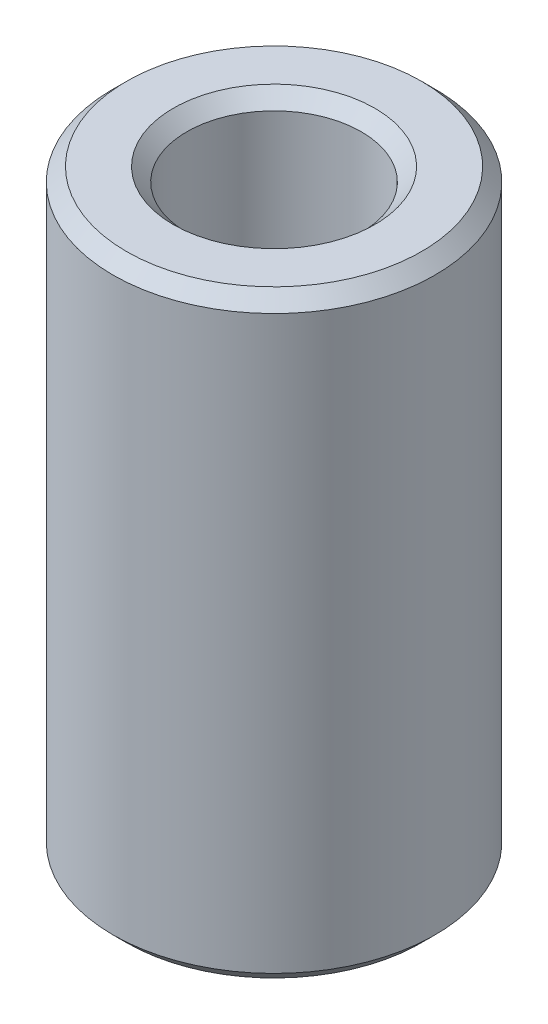
ISO-10303-21;
HEADER;
FILE_DESCRIPTION(('STEP AP214'),'2;1');
FILE_NAME('part.step','',(''),(''),'','','');
FILE_SCHEMA(('AUTOMOTIVE_DESIGN { 1 0 10303 214 1 1 1 1 }'));
ENDSEC;
DATA;
#1=APPLICATION_CONTEXT('core data for automotive mechanical design processes');
#2=APPLICATION_PROTOCOL_DEFINITION('international standard','automotive_design',2000,#1);
#3=PRODUCT_CONTEXT('',#1,'mechanical');
#4=PRODUCT('Part','Part','',(#3));
#5=PRODUCT_RELATED_PRODUCT_CATEGORY('part','',(#4));
#6=PRODUCT_DEFINITION_FORMATION('','',#4);
#7=PRODUCT_DEFINITION_CONTEXT('part definition',#1,'design');
#8=PRODUCT_DEFINITION('design','',#6,#7);
#9=PRODUCT_DEFINITION_SHAPE('','',#8);
#10=(LENGTH_UNIT() NAMED_UNIT(*) SI_UNIT(.MILLI.,.METRE.));
#11=(NAMED_UNIT(*) PLANE_ANGLE_UNIT() SI_UNIT($,.RADIAN.));
#12=(NAMED_UNIT(*) SI_UNIT($,.STERADIAN.) SOLID_ANGLE_UNIT());
#13=UNCERTAINTY_MEASURE_WITH_UNIT(LENGTH_MEASURE(1.E-05),#10,'distance_accuracy_value','');
#14=(GEOMETRIC_REPRESENTATION_CONTEXT(3) GLOBAL_UNCERTAINTY_ASSIGNED_CONTEXT((#13)) GLOBAL_UNIT_ASSIGNED_CONTEXT((#10,
#11,#12)) REPRESENTATION_CONTEXT('',''));
#15=CARTESIAN_POINT('',(0.,0.,0.));
#16=DIRECTION('',(0.,0.,1.));
#17=DIRECTION('',(1.,0.,0.));
#18=AXIS2_PLACEMENT_3D('',#15,#16,#17);
#19=CARTESIAN_POINT('',(0.,46.4537230556615,0.));
#20=DIRECTION('',(0.,-1.,0.));
#21=DIRECTION('',(0.,0.,-1.));
#22=AXIS2_PLACEMENT_3D('',#19,#20,#21);
#23=CYLINDRICAL_SURFACE('',#22,12.5);
#24=CARTESIAN_POINT('',(0.,1.05193500910648,0.));
#25=DIRECTION('',(0.,1.,0.));
#26=DIRECTION('',(0.,0.,1.));
#27=AXIS2_PLACEMENT_3D('',#24,#25,#26);
#28=CIRCLE('',#27,12.5);
#29=CARTESIAN_POINT('',(0.,1.05193500910648,12.5));
#30=VERTEX_POINT('',#29);
#31=EDGE_CURVE('E10',#30,#30,#28,.T.);
#32=ORIENTED_EDGE('',*,*,#31,.T.);
#33=EDGE_LOOP('',(#32));
#34=FACE_BOUND('',#33,.T.);
#35=CARTESIAN_POINT('',(0.,45.401788046555,0.));
#36=DIRECTION('',(0.,1.,0.));
#37=DIRECTION('',(0.,0.,1.));
#38=AXIS2_PLACEMENT_3D('',#35,#36,#37);
#39=CIRCLE('',#38,12.5);
#40=CARTESIAN_POINT('',(0.,45.401788046555,12.5));
#41=VERTEX_POINT('',#40);
#42=EDGE_CURVE('E50',#41,#41,#39,.F.);
#43=ORIENTED_EDGE('',*,*,#42,.T.);
#44=EDGE_LOOP('',(#43));
#45=FACE_BOUND('',#44,.T.);
#46=ADVANCED_FACE('F39',(#34,#45),#23,.T.);
#47=CARTESIAN_POINT('',(0.,46.4537230556615,0.));
#48=DIRECTION('',(0.,1.,0.));
#49=DIRECTION('',(0.,0.,1.));
#50=AXIS2_PLACEMENT_3D('',#47,#48,#49);
#51=PLANE('',#50);
#52=CARTESIAN_POINT('',(0.,46.4537230556615,0.));
#53=DIRECTION('',(0.,1.,0.));
#54=DIRECTION('',(0.,0.,1.));
#55=AXIS2_PLACEMENT_3D('',#52,#53,#54);
#56=CIRCLE('',#55,7.82351300067226);
#57=CARTESIAN_POINT('',(0.,46.4537230556615,7.82351300067226));
#58=VERTEX_POINT('',#57);
#59=EDGE_CURVE('E58',#58,#58,#56,.F.);
#60=ORIENTED_EDGE('',*,*,#59,.T.);
#61=EDGE_LOOP('',(#60));
#62=FACE_BOUND('',#61,.T.);
#63=CARTESIAN_POINT('',(0.,46.4537230556615,0.));
#64=DIRECTION('',(0.,1.,0.));
#65=DIRECTION('',(0.,0.,1.));
#66=AXIS2_PLACEMENT_3D('',#63,#64,#65);
#67=CIRCLE('',#66,11.4480649908935);
#68=CARTESIAN_POINT('',(0.,46.4537230556615,11.4480649908935));
#69=VERTEX_POINT('',#68);
#70=EDGE_CURVE('E61',#69,#69,#67,.T.);
#71=ORIENTED_EDGE('',*,*,#70,.T.);
#72=EDGE_LOOP('',(#71));
#73=FACE_BOUND('',#72,.T.);
#74=ADVANCED_FACE('F88',(#62,#73),#51,.T.);
#75=CARTESIAN_POINT('',(0.,0.,0.));
#76=DIRECTION('',(0.,1.,0.));
#77=DIRECTION('',(0.,0.,1.));
#78=AXIS2_PLACEMENT_3D('',#75,#76,#77);
#79=PLANE('',#78);
#80=CARTESIAN_POINT('',(0.,0.,0.));
#81=DIRECTION('',(0.,1.,0.));
#82=DIRECTION('',(0.,0.,1.));
#83=AXIS2_PLACEMENT_3D('',#80,#81,#82);
#84=CIRCLE('',#83,7.82351300067225);
#85=CARTESIAN_POINT('',(0.,0.,7.82351300067225));
#86=VERTEX_POINT('',#85);
#87=EDGE_CURVE('E51',#86,#86,#84,.T.);
#88=ORIENTED_EDGE('',*,*,#87,.T.);
#89=EDGE_LOOP('',(#88));
#90=FACE_BOUND('',#89,.T.);
#91=CARTESIAN_POINT('',(0.,0.,0.));
#92=DIRECTION('',(0.,1.,0.));
#93=DIRECTION('',(0.,0.,1.));
#94=AXIS2_PLACEMENT_3D('',#91,#92,#93);
#95=CIRCLE('',#94,11.4480649908935);
#96=CARTESIAN_POINT('',(0.,0.,11.4480649908935));
#97=VERTEX_POINT('',#96);
#98=EDGE_CURVE('E54',#97,#97,#95,.F.);
#99=ORIENTED_EDGE('',*,*,#98,.T.);
#100=EDGE_LOOP('',(#99));
#101=FACE_BOUND('',#100,.T.);
#102=ADVANCED_FACE('F83',(#90,#101),#79,.F.);
#103=CARTESIAN_POINT('',(0.,46.4537230556615,0.));
#104=DIRECTION('',(0.,-1.,0.));
#105=DIRECTION('',(0.,0.,-1.));
#106=AXIS2_PLACEMENT_3D('',#103,#104,#105);
#107=CYLINDRICAL_SURFACE('',#106,6.77157799156576);
#108=CARTESIAN_POINT('',(0.,45.401788046555,0.));
#109=DIRECTION('',(0.,1.,0.));
#110=DIRECTION('',(0.,0.,1.));
#111=AXIS2_PLACEMENT_3D('',#108,#109,#110);
#112=CIRCLE('',#111,6.77157799156576);
#113=CARTESIAN_POINT('',(0.,45.401788046555,6.77157799156576));
#114=VERTEX_POINT('',#113);
#115=EDGE_CURVE('E67',#114,#114,#112,.T.);
#116=ORIENTED_EDGE('',*,*,#115,.T.);
#117=EDGE_LOOP('',(#116));
#118=FACE_BOUND('',#117,.T.);
#119=CARTESIAN_POINT('',(0.,1.05193500910649,0.));
#120=DIRECTION('',(0.,1.,0.));
#121=DIRECTION('',(0.,0.,1.));
#122=AXIS2_PLACEMENT_3D('',#119,#120,#121);
#123=CIRCLE('',#122,6.77157799156576);
#124=CARTESIAN_POINT('',(0.,1.05193500910649,6.77157799156576));
#125=VERTEX_POINT('',#124);
#126=EDGE_CURVE('E69',#125,#125,#123,.F.);
#127=ORIENTED_EDGE('',*,*,#126,.T.);
#128=EDGE_LOOP('',(#127));
#129=FACE_BOUND('',#128,.T.);
#130=ADVANCED_FACE('F71',(#118,#129),#107,.F.);
#131=CARTESIAN_POINT('',(0.,45.401788046555,0.));
#132=DIRECTION('',(0.,1.,0.));
#133=DIRECTION('',(0.,0.,1.));
#134=AXIS2_PLACEMENT_3D('',#131,#132,#133);
#135=CONICAL_SURFACE('',#134,6.77157799156576,0.785398163397458);
#136=ORIENTED_EDGE('',*,*,#59,.F.);
#137=EDGE_LOOP('',(#136));
#138=FACE_BOUND('',#137,.T.);
#139=ORIENTED_EDGE('',*,*,#115,.F.);
#140=EDGE_LOOP('',(#139));
#141=FACE_BOUND('',#140,.T.);
#142=ADVANCED_FACE('F77',(#138,#141),#135,.F.);
#143=CARTESIAN_POINT('',(0.,0.,0.));
#144=DIRECTION('',(0.,-1.,0.));
#145=DIRECTION('',(0.,0.,-1.));
#146=AXIS2_PLACEMENT_3D('',#143,#144,#145);
#147=CONICAL_SURFACE('',#146,7.82351300067225,0.785398163397448);
#148=ORIENTED_EDGE('',*,*,#126,.F.);
#149=EDGE_LOOP('',(#148));
#150=FACE_BOUND('',#149,.T.);
#151=ORIENTED_EDGE('',*,*,#87,.F.);
#152=EDGE_LOOP('',(#151));
#153=FACE_BOUND('',#152,.T.);
#154=ADVANCED_FACE('F73',(#150,#153),#147,.F.);
#155=CARTESIAN_POINT('',(0.,1.05193500910648,0.));
#156=DIRECTION('',(0.,1.,0.));
#157=DIRECTION('',(0.,0.,1.));
#158=AXIS2_PLACEMENT_3D('',#155,#156,#157);
#159=CONICAL_SURFACE('',#158,12.5,0.785398163397452);
#160=CARTESIAN_POINT('',(0.,0.,11.4480649908935));
#161=CARTESIAN_POINT('',(0.,0.0109576563448592,11.4590226472384));
#162=CARTESIAN_POINT('',(0.,0.0219153126897183,11.4699803035832));
#163=CARTESIAN_POINT('',(0.,0.0438306253794365,11.4918956162729));
#164=CARTESIAN_POINT('',(0.,0.0547882817242956,11.5028532726178));
#165=CARTESIAN_POINT('',(0.,0.0767035944140141,11.5247685853075));
#166=CARTESIAN_POINT('',(0.,0.0876612507588734,11.5357262416524));
#167=CARTESIAN_POINT('',(0.,0.109576563448592,11.5576415543421));
#168=CARTESIAN_POINT('',(0.,0.120534219793451,11.568599210687));
#169=CARTESIAN_POINT('',(0.,0.142449532483169,11.5905145233767));
#170=CARTESIAN_POINT('',(0.,0.153407188828028,11.6014721797215));
#171=CARTESIAN_POINT('',(0.,0.175322501517747,11.6233874924113));
#172=CARTESIAN_POINT('',(0.,0.186280157862606,11.6343451487561));
#173=CARTESIAN_POINT('',(0.,0.208195470552325,11.6562604614458));
#174=CARTESIAN_POINT('',(0.,0.219153126897184,11.6672181177907));
#175=CARTESIAN_POINT('',(0.,0.241068439586902,11.6891334304804));
#176=CARTESIAN_POINT('',(0.,0.252026095931761,11.7000910868253));
#177=CARTESIAN_POINT('',(0.,0.27394140862148,11.722006399515));
#178=CARTESIAN_POINT('',(0.,0.284899064966339,11.7329640558598));
#179=CARTESIAN_POINT('',(0.,0.306814377656057,11.7548793685496));
#180=CARTESIAN_POINT('',(0.,0.317772034000917,11.7658370248944));
#181=CARTESIAN_POINT('',(0.,0.339687346690635,11.7877523375841));
#182=CARTESIAN_POINT('',(0.,0.350645003035494,11.798709993929));
#183=CARTESIAN_POINT('',(0.,0.372560315725213,11.8206253066187));
#184=CARTESIAN_POINT('',(0.,0.383517972070072,11.8315829629636));
#185=CARTESIAN_POINT('',(0.,0.40543328475979,11.8534982756533));
#186=CARTESIAN_POINT('',(0.,0.416390941104649,11.8644559319982));
#187=CARTESIAN_POINT('',(0.,0.438306253794368,11.8863712446879));
#188=CARTESIAN_POINT('',(0.,0.449263910139227,11.8973289010327));
#189=CARTESIAN_POINT('',(0.,0.471179222828945,11.9192442137225));
#190=CARTESIAN_POINT('',(0.,0.482136879173805,11.9302018700673));
#191=CARTESIAN_POINT('',(0.,0.504052191863523,11.952117182757));
#192=CARTESIAN_POINT('',(0.,0.515009848208382,11.9630748391019));
#193=CARTESIAN_POINT('',(0.,0.536925160898101,11.9849901517916));
#194=CARTESIAN_POINT('',(0.,0.54788281724296,11.9959478081365));
#195=CARTESIAN_POINT('',(0.,0.569798129932678,12.0178631208262));
#196=CARTESIAN_POINT('',(0.,0.580755786277537,12.0288207771711));
#197=CARTESIAN_POINT('',(0.,0.602671098967256,12.0507360898608));
#198=CARTESIAN_POINT('',(0.,0.613628755312115,12.0616937462056));
#199=CARTESIAN_POINT('',(0.,0.635544068001833,12.0836090588953));
#200=CARTESIAN_POINT('',(0.,0.646501724346693,12.0945667152402));
#201=CARTESIAN_POINT('',(0.,0.668417037036411,12.1164820279299));
#202=CARTESIAN_POINT('',(0.,0.67937469338127,12.1274396842748));
#203=CARTESIAN_POINT('',(0.,0.701290006070989,12.1493549969645));
#204=CARTESIAN_POINT('',(0.,0.712247662415848,12.1603126533094));
#205=CARTESIAN_POINT('',(0.,0.734162975105566,12.1822279659991));
#206=CARTESIAN_POINT('',(0.,0.745120631450426,12.1931856223439));
#207=CARTESIAN_POINT('',(0.,0.767035944140144,12.2151009350337));
#208=CARTESIAN_POINT('',(0.,0.777993600485003,12.2260585913785));
#209=CARTESIAN_POINT('',(0.,0.799908913174722,12.2479739040682));
#210=CARTESIAN_POINT('',(0.,0.810866569519581,12.2589315604131));
#211=CARTESIAN_POINT('',(0.,0.832781882209299,12.2808468731028));
#212=CARTESIAN_POINT('',(0.,0.843739538554158,12.2918045294477));
#213=CARTESIAN_POINT('',(0.,0.865654851243877,12.3137198421374));
#214=CARTESIAN_POINT('',(0.,0.876612507588736,12.3246774984823));
#215=CARTESIAN_POINT('',(0.,0.898527820278454,12.346592811172));
#216=CARTESIAN_POINT('',(0.,0.909485476623314,12.3575504675168));
#217=CARTESIAN_POINT('',(0.,0.931400789313032,12.3794657802065));
#218=CARTESIAN_POINT('',(0.,0.942358445657891,12.3904234365514));
#219=CARTESIAN_POINT('',(0.,0.96427375834761,12.4123387492411));
#220=CARTESIAN_POINT('',(0.,0.975231414692469,12.423296405586));
#221=CARTESIAN_POINT('',(0.,0.997146727382187,12.4452117182757));
#222=CARTESIAN_POINT('',(0.,1.00810438372705,12.4561693746206));
#223=CARTESIAN_POINT('',(0.,1.03001969641676,12.4780846873103));
#224=CARTESIAN_POINT('',(0.,1.04097735276162,12.4890423436551));
#225=CARTESIAN_POINT('',(0.,1.05193500910648,12.5));
#226=B_SPLINE_CURVE_WITH_KNOTS('',3,(#160,#161,#162,#163,#164,#165,#166,#167,#168,#169,#170,
#171,#172,#173,#174,#175,#176,#177,#178,#179,#180,#181,#182,#183,#184,#185,#186,#187,#188,#189,
#190,#191,#192,#193,#194,#195,#196,#197,#198,#199,#200,#201,#202,#203,#204,#205,#206,#207,#208,
#209,#210,#211,#212,#213,#214,#215,#216,#217,#218,#219,#220,#221,#222,#223,#224,#225),
.UNSPECIFIED.,.F.,.F.,(4,2,2,2,2,2,2,2,2,2,2,2,2,2,2,2,2,2,2,2,2,2,2,2,2,2,2,2,2,2,2,2,4),(0.,
0.0464893986441707,0.0929787972883415,0.139468195932511,0.185957594576682,0.232446993220852,
0.278936391865023,0.325425790509194,0.371915189153365,0.418404587797536,0.464893986441706,
0.511383385085877,0.557872783730048,0.604362182374219,0.650851581018389,0.69734097966256,
0.74383037830673,0.7903197769509,0.836809175595071,0.883298574239242,0.929787972883413,
0.976277371527583,1.02276677017175,1.06925616881592,1.1157455674601,1.16223496610427,
1.20872436474844,1.25521376339261,1.30170316203678,1.34819256068095,1.39468195932512,
1.44117135796929,1.48766075661346),.UNSPECIFIED.);
#227=EDGE_CURVE('BSEAM76',#97,#30,#226,.T.);
#228=ORIENTED_EDGE('',*,*,#98,.F.);
#229=ORIENTED_EDGE('',*,*,#31,.F.);
#230=ORIENTED_EDGE('',*,*,#227,.T.);
#231=ORIENTED_EDGE('',*,*,#227,.F.);
#232=EDGE_LOOP('',(#228,#230,#229,#231));
#233=FACE_BOUND('',#232,.T.);
#234=ADVANCED_FACE('F76',(#233),#159,.T.);
#235=CARTESIAN_POINT('',(0.,46.4537230556615,0.));
#236=DIRECTION('',(0.,-1.,0.));
#237=DIRECTION('',(0.,0.,-1.));
#238=AXIS2_PLACEMENT_3D('',#235,#236,#237);
#239=CONICAL_SURFACE('',#238,11.4480649908935,0.785398163397443);
#240=ORIENTED_EDGE('',*,*,#42,.F.);
#241=EDGE_LOOP('',(#240));
#242=FACE_BOUND('',#241,.T.);
#243=ORIENTED_EDGE('',*,*,#70,.F.);
#244=EDGE_LOOP('',(#243));
#245=FACE_BOUND('',#244,.T.);
#246=ADVANCED_FACE('F45',(#242,#245),#239,.T.);
#247=CLOSED_SHELL('',(#46,#74,#102,#130,#142,#154,#234,#246));
#248=MANIFOLD_SOLID_BREP('B2',#247);
#249=ADVANCED_BREP_SHAPE_REPRESENTATION('',(#18,#248),#14);
#250=SHAPE_DEFINITION_REPRESENTATION(#9,#249);
ENDSEC;
END-ISO-10303-21;
